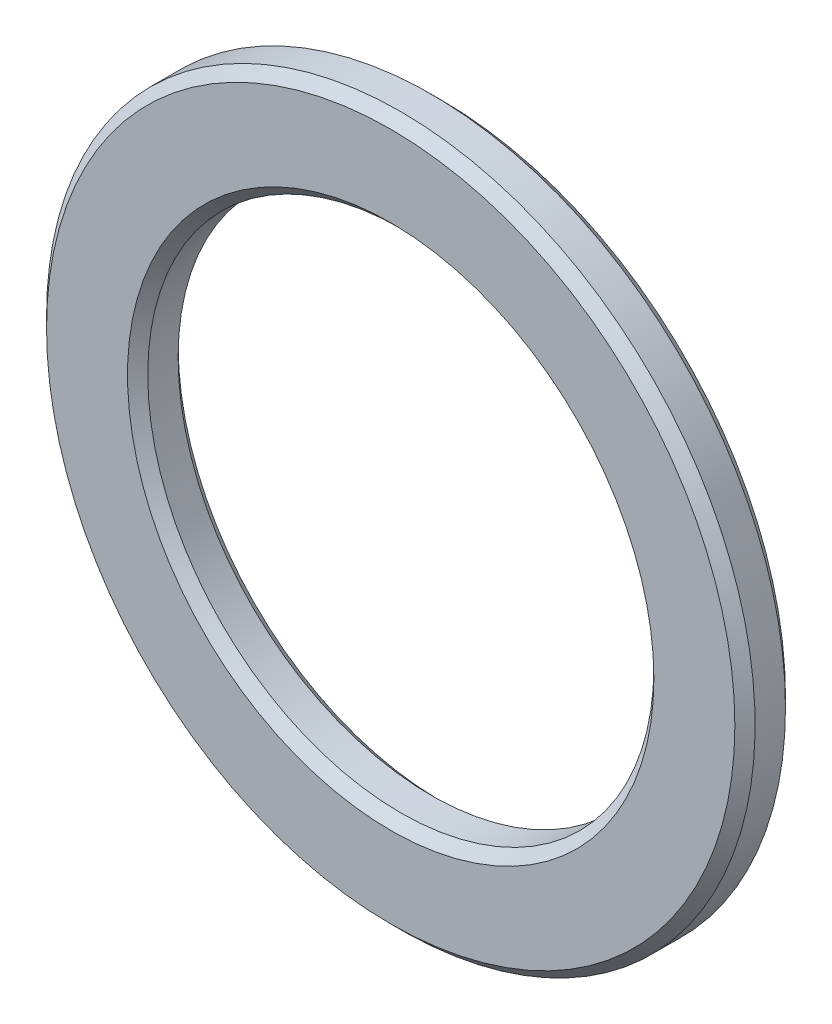
ISO-10303-21;
HEADER;
FILE_DESCRIPTION(('STEP AP214'),'2;1');
FILE_NAME('part.step','',(''),(''),'','','');
FILE_SCHEMA(('AUTOMOTIVE_DESIGN { 1 0 10303 214 1 1 1 1 }'));
ENDSEC;
DATA;
#1=APPLICATION_CONTEXT('core data for automotive mechanical design processes');
#2=APPLICATION_PROTOCOL_DEFINITION('international standard','automotive_design',2000,#1);
#3=PRODUCT_CONTEXT('',#1,'mechanical');
#4=PRODUCT('Part','Part','',(#3));
#5=PRODUCT_RELATED_PRODUCT_CATEGORY('part','',(#4));
#6=PRODUCT_DEFINITION_FORMATION('','',#4);
#7=PRODUCT_DEFINITION_CONTEXT('part definition',#1,'design');
#8=PRODUCT_DEFINITION('design','',#6,#7);
#9=PRODUCT_DEFINITION_SHAPE('','',#8);
#10=(LENGTH_UNIT() NAMED_UNIT(*) SI_UNIT(.MILLI.,.METRE.));
#11=(NAMED_UNIT(*) PLANE_ANGLE_UNIT() SI_UNIT($,.RADIAN.));
#12=(NAMED_UNIT(*) SI_UNIT($,.STERADIAN.) SOLID_ANGLE_UNIT());
#13=UNCERTAINTY_MEASURE_WITH_UNIT(LENGTH_MEASURE(1.E-05),#10,'distance_accuracy_value','');
#14=(GEOMETRIC_REPRESENTATION_CONTEXT(3) GLOBAL_UNCERTAINTY_ASSIGNED_CONTEXT((#13)) GLOBAL_UNIT_ASSIGNED_CONTEXT((#10,
#11,#12)) REPRESENTATION_CONTEXT('',''));
#15=CARTESIAN_POINT('',(0.,0.,0.));
#16=DIRECTION('',(0.,0.,1.));
#17=DIRECTION('',(1.,0.,0.));
#18=AXIS2_PLACEMENT_3D('',#15,#16,#17);
#19=CARTESIAN_POINT('',(0.,0.,0.5));
#20=DIRECTION('',(0.,0.,1.));
#21=DIRECTION('',(1.,0.,0.));
#22=AXIS2_PLACEMENT_3D('',#19,#20,#21);
#23=PLANE('',#22);
#24=CARTESIAN_POINT('',(0.,0.,0.499999999988177));
#25=DIRECTION('',(0.,0.,-1.));
#26=DIRECTION('',(0.,1.,0.));
#27=AXIS2_PLACEMENT_3D('',#24,#25,#26);
#28=CIRCLE('',#27,3.39999999999918);
#29=CARTESIAN_POINT('',(0.,3.39999999999918,0.499999999988177));
#30=VERTEX_POINT('',#29);
#31=EDGE_CURVE('E31',#30,#30,#28,.T.);
#32=ORIENTED_EDGE('',*,*,#31,.F.);
#33=EDGE_LOOP('',(#32));
#34=FACE_BOUND('',#33,.T.);
#35=CARTESIAN_POINT('',(0.,0.,0.499999999988177));
#36=DIRECTION('',(0.,0.,1.));
#37=DIRECTION('',(1.,0.,0.));
#38=AXIS2_PLACEMENT_3D('',#35,#36,#37);
#39=CIRCLE('',#38,2.59999999997263);
#40=CARTESIAN_POINT('',(2.59999999997263,0.,0.499999999988177));
#41=VERTEX_POINT('',#40);
#42=EDGE_CURVE('E17',#41,#41,#39,.F.);
#43=ORIENTED_EDGE('',*,*,#42,.T.);
#44=EDGE_LOOP('',(#43));
#45=FACE_BOUND('',#44,.T.);
#46=ADVANCED_FACE('F14',(#34,#45),#23,.T.);
#47=CARTESIAN_POINT('',(0.,0.,0.49999999987449));
#48=DIRECTION('',(0.,0.,1.));
#49=DIRECTION('',(1.,0.,0.));
#50=AXIS2_PLACEMENT_3D('',#47,#48,#49);
#51=CONICAL_SURFACE('',#50,2.59999999985894,0.785398163397448);
#52=ORIENTED_EDGE('',*,*,#42,.F.);
#53=EDGE_LOOP('',(#52));
#54=FACE_BOUND('',#53,.T.);
#55=CARTESIAN_POINT('',(0.,0.,0.4));
#56=DIRECTION('',(0.,0.,-1.));
#57=DIRECTION('',(-1.,0.,0.));
#58=AXIS2_PLACEMENT_3D('',#55,#56,#57);
#59=CIRCLE('',#58,2.5);
#60=CARTESIAN_POINT('',(-2.5,0.,0.4));
#61=VERTEX_POINT('',#60);
#62=EDGE_CURVE('E29',#61,#61,#59,.T.);
#63=ORIENTED_EDGE('',*,*,#62,.T.);
#64=EDGE_LOOP('',(#63));
#65=FACE_BOUND('',#64,.T.);
#66=ADVANCED_FACE('F41',(#54,#65),#51,.F.);
#67=CARTESIAN_POINT('',(0.,0.,0.400000000070122));
#68=DIRECTION('',(0.,0.,-1.));
#69=DIRECTION('',(0.,1.,0.));
#70=AXIS2_PLACEMENT_3D('',#67,#68,#69);
#71=CONICAL_SURFACE('',#70,3.49999999997408,0.785398163681665);
#72=ORIENTED_EDGE('',*,*,#31,.T.);
#73=EDGE_LOOP('',(#72));
#74=FACE_BOUND('',#73,.T.);
#75=CARTESIAN_POINT('',(0.,0.,0.4));
#76=DIRECTION('',(0.,0.,-1.));
#77=DIRECTION('',(-1.,0.,0.));
#78=AXIS2_PLACEMENT_3D('',#75,#76,#77);
#79=CIRCLE('',#78,3.5);
#80=CARTESIAN_POINT('',(-3.5,0.,0.4));
#81=VERTEX_POINT('',#80);
#82=EDGE_CURVE('E36',#81,#81,#79,.T.);
#83=ORIENTED_EDGE('',*,*,#82,.F.);
#84=EDGE_LOOP('',(#83));
#85=FACE_BOUND('',#84,.T.);
#86=ADVANCED_FACE('F44',(#74,#85),#71,.T.);
#87=CARTESIAN_POINT('',(0.,0.,0.5));
#88=DIRECTION('',(0.,0.,-1.));
#89=DIRECTION('',(-1.,0.,0.));
#90=AXIS2_PLACEMENT_3D('',#87,#88,#89);
#91=CYLINDRICAL_SURFACE('',#90,2.5);
#92=CARTESIAN_POINT('',(0.,0.,0.0999999999748979));
#93=DIRECTION('',(0.,0.,-1.));
#94=DIRECTION('',(-1.,0.,0.));
#95=AXIS2_PLACEMENT_3D('',#92,#93,#94);
#96=CIRCLE('',#95,2.49999999999772);
#97=CARTESIAN_POINT('',(-2.49999999999772,0.,0.0999999999748979));
#98=VERTEX_POINT('',#97);
#99=EDGE_CURVE('E80',#98,#98,#96,.T.);
#100=ORIENTED_EDGE('',*,*,#99,.T.);
#101=EDGE_LOOP('',(#100));
#102=FACE_BOUND('',#101,.T.);
#103=ORIENTED_EDGE('',*,*,#62,.F.);
#104=EDGE_LOOP('',(#103));
#105=FACE_BOUND('',#104,.T.);
#106=ADVANCED_FACE('F47',(#102,#105),#91,.F.);
#107=CARTESIAN_POINT('',(0.,0.,0.5));
#108=DIRECTION('',(0.,0.,-1.));
#109=DIRECTION('',(-1.,0.,0.));
#110=AXIS2_PLACEMENT_3D('',#107,#108,#109);
#111=CYLINDRICAL_SURFACE('',#110,3.5);
#112=ORIENTED_EDGE('',*,*,#82,.T.);
#113=EDGE_LOOP('',(#112));
#114=FACE_BOUND('',#113,.T.);
#115=CARTESIAN_POINT('',(0.,0.,0.100000000031741));
#116=DIRECTION('',(0.,0.,1.));
#117=DIRECTION('',(1.,0.,0.));
#118=AXIS2_PLACEMENT_3D('',#115,#116,#117);
#119=CIRCLE('',#118,3.49999999997408);
#120=CARTESIAN_POINT('',(3.49999999997408,0.,0.100000000031741));
#121=VERTEX_POINT('',#120);
#122=EDGE_CURVE('E26',#121,#121,#119,.F.);
#123=ORIENTED_EDGE('',*,*,#122,.F.);
#124=EDGE_LOOP('',(#123));
#125=FACE_BOUND('',#124,.T.);
#126=ADVANCED_FACE('F49',(#114,#125),#111,.T.);
#127=CARTESIAN_POINT('',(0.,0.,-5.6843418860808E-11));
#128=DIRECTION('',(0.,0.,-1.));
#129=DIRECTION('',(-1.,0.,0.));
#130=AXIS2_PLACEMENT_3D('',#127,#128,#129);
#131=CONICAL_SURFACE('',#130,2.60000000002947,0.785398163397448);
#132=CARTESIAN_POINT('',(0.,0.,5.6843418860808E-11));
#133=DIRECTION('',(0.,0.,-1.));
#134=DIRECTION('',(-1.,0.,0.));
#135=AXIS2_PLACEMENT_3D('',#132,#133,#134);
#136=CIRCLE('',#135,2.59999999991578);
#137=CARTESIAN_POINT('',(-2.59999999991578,0.,5.6843418860808E-11));
#138=VERTEX_POINT('',#137);
#139=EDGE_CURVE('E21',#138,#138,#136,.T.);
#140=ORIENTED_EDGE('',*,*,#139,.T.);
#141=EDGE_LOOP('',(#140));
#142=FACE_BOUND('',#141,.T.);
#143=ORIENTED_EDGE('',*,*,#99,.F.);
#144=EDGE_LOOP('',(#143));
#145=FACE_BOUND('',#144,.T.);
#146=ADVANCED_FACE('F57',(#142,#145),#131,.F.);
#147=CARTESIAN_POINT('',(0.,0.,0.100000000031741));
#148=DIRECTION('',(0.,0.,1.));
#149=DIRECTION('',(1.,0.,0.));
#150=AXIS2_PLACEMENT_3D('',#147,#148,#149);
#151=CONICAL_SURFACE('',#150,3.49999999997408,0.785398163397448);
#152=CARTESIAN_POINT('',(0.,0.,5.6843418860808E-11));
#153=DIRECTION('',(0.,0.,1.));
#154=DIRECTION('',(1.,0.,0.));
#155=AXIS2_PLACEMENT_3D('',#152,#153,#154);
#156=CIRCLE('',#155,3.39999999999918);
#157=CARTESIAN_POINT('',(3.39999999999918,0.,5.6843418860808E-11));
#158=VERTEX_POINT('',#157);
#159=EDGE_CURVE('E10',#158,#158,#156,.T.);
#160=ORIENTED_EDGE('',*,*,#159,.T.);
#161=EDGE_LOOP('',(#160));
#162=FACE_BOUND('',#161,.T.);
#163=ORIENTED_EDGE('',*,*,#122,.T.);
#164=EDGE_LOOP('',(#163));
#165=FACE_BOUND('',#164,.T.);
#166=ADVANCED_FACE('F64',(#162,#165),#151,.T.);
#167=CARTESIAN_POINT('',(0.,0.,0.));
#168=DIRECTION('',(0.,0.,1.));
#169=DIRECTION('',(1.,0.,0.));
#170=AXIS2_PLACEMENT_3D('',#167,#168,#169);
#171=PLANE('',#170);
#172=ORIENTED_EDGE('',*,*,#159,.F.);
#173=EDGE_LOOP('',(#172));
#174=FACE_BOUND('',#173,.T.);
#175=ORIENTED_EDGE('',*,*,#139,.F.);
#176=EDGE_LOOP('',(#175));
#177=FACE_BOUND('',#176,.T.);
#178=ADVANCED_FACE('F62',(#174,#177),#171,.F.);
#179=CLOSED_SHELL('',(#46,#66,#86,#106,#126,#146,#166,#178));
#180=MANIFOLD_SOLID_BREP('B1',#179);
#181=ADVANCED_BREP_SHAPE_REPRESENTATION('',(#18,#180),#14);
#182=SHAPE_DEFINITION_REPRESENTATION(#9,#181);
ENDSEC;
END-ISO-10303-21;
